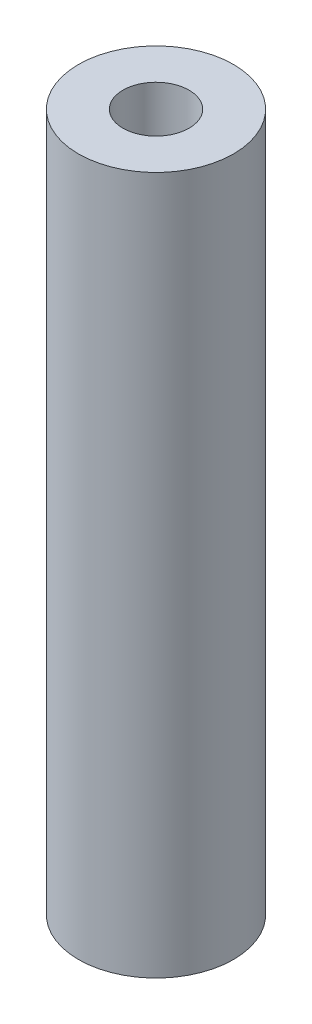
ISO-10303-21;
HEADER;
FILE_DESCRIPTION(('STEP AP214'),'2;1');
FILE_NAME('part.step','',(''),(''),'','','');
FILE_SCHEMA(('AUTOMOTIVE_DESIGN { 1 0 10303 214 1 1 1 1 }'));
ENDSEC;
DATA;
#1=APPLICATION_CONTEXT('core data for automotive mechanical design processes');
#2=APPLICATION_PROTOCOL_DEFINITION('international standard','automotive_design',2000,#1);
#3=PRODUCT_CONTEXT('',#1,'mechanical');
#4=PRODUCT('Part','Part','',(#3));
#5=PRODUCT_RELATED_PRODUCT_CATEGORY('part','',(#4));
#6=PRODUCT_DEFINITION_FORMATION('','',#4);
#7=PRODUCT_DEFINITION_CONTEXT('part definition',#1,'design');
#8=PRODUCT_DEFINITION('design','',#6,#7);
#9=PRODUCT_DEFINITION_SHAPE('','',#8);
#10=(LENGTH_UNIT() NAMED_UNIT(*) SI_UNIT(.MILLI.,.METRE.));
#11=(NAMED_UNIT(*) PLANE_ANGLE_UNIT() SI_UNIT($,.RADIAN.));
#12=(NAMED_UNIT(*) SI_UNIT($,.STERADIAN.) SOLID_ANGLE_UNIT());
#13=UNCERTAINTY_MEASURE_WITH_UNIT(LENGTH_MEASURE(1.E-05),#10,'distance_accuracy_value','');
#14=(GEOMETRIC_REPRESENTATION_CONTEXT(3) GLOBAL_UNCERTAINTY_ASSIGNED_CONTEXT((#13)) GLOBAL_UNIT_ASSIGNED_CONTEXT((#10,
#11,#12)) REPRESENTATION_CONTEXT('',''));
#15=CARTESIAN_POINT('',(0.,0.,0.));
#16=DIRECTION('',(0.,0.,1.));
#17=DIRECTION('',(1.,0.,0.));
#18=AXIS2_PLACEMENT_3D('',#15,#16,#17);
#19=CARTESIAN_POINT('',(0.,28.575,0.));
#20=DIRECTION('',(0.,-1.,0.));
#21=DIRECTION('',(0.,0.,-1.));
#22=AXIS2_PLACEMENT_3D('',#19,#20,#21);
#23=CYLINDRICAL_SURFACE('',#22,3.175);
#24=CARTESIAN_POINT('',(0.,28.575,0.));
#25=DIRECTION('',(0.,1.,0.));
#26=DIRECTION('',(0.,0.,1.));
#27=AXIS2_PLACEMENT_3D('',#24,#25,#26);
#28=CIRCLE('',#27,3.175);
#29=CARTESIAN_POINT('',(0.,28.575,3.175));
#30=VERTEX_POINT('',#29);
#31=EDGE_CURVE('E10',#30,#30,#28,.T.);
#32=ORIENTED_EDGE('',*,*,#31,.F.);
#33=EDGE_LOOP('',(#32));
#34=FACE_BOUND('',#33,.T.);
#35=CARTESIAN_POINT('',(0.,0.,0.));
#36=DIRECTION('',(0.,1.,0.));
#37=DIRECTION('',(0.,0.,1.));
#38=AXIS2_PLACEMENT_3D('',#35,#36,#37);
#39=CIRCLE('',#38,3.175);
#40=CARTESIAN_POINT('',(0.,0.,3.175));
#41=VERTEX_POINT('',#40);
#42=EDGE_CURVE('E34',#41,#41,#39,.T.);
#43=ORIENTED_EDGE('',*,*,#42,.T.);
#44=EDGE_LOOP('',(#43));
#45=FACE_BOUND('',#44,.T.);
#46=ADVANCED_FACE('F31',(#34,#45),#23,.T.);
#47=CARTESIAN_POINT('',(0.,28.575,0.));
#48=DIRECTION('',(0.,1.,0.));
#49=DIRECTION('',(0.,0.,1.));
#50=AXIS2_PLACEMENT_3D('',#47,#48,#49);
#51=PLANE('',#50);
#52=CARTESIAN_POINT('',(0.,28.575,0.));
#53=DIRECTION('',(0.,1.,0.));
#54=DIRECTION('',(0.,0.,1.));
#55=AXIS2_PLACEMENT_3D('',#52,#53,#54);
#56=CIRCLE('',#55,1.35254999999999);
#57=CARTESIAN_POINT('',(0.,28.575,1.35254999999999));
#58=VERTEX_POINT('',#57);
#59=EDGE_CURVE('E45',#58,#58,#56,.T.);
#60=ORIENTED_EDGE('',*,*,#59,.F.);
#61=EDGE_LOOP('',(#60));
#62=FACE_BOUND('',#61,.T.);
#63=ORIENTED_EDGE('',*,*,#31,.T.);
#64=EDGE_LOOP('',(#63));
#65=FACE_BOUND('',#64,.T.);
#66=ADVANCED_FACE('F51',(#62,#65),#51,.T.);
#67=CARTESIAN_POINT('',(0.,0.,0.));
#68=DIRECTION('',(0.,1.,0.));
#69=DIRECTION('',(0.,0.,1.));
#70=AXIS2_PLACEMENT_3D('',#67,#68,#69);
#71=PLANE('',#70);
#72=CARTESIAN_POINT('',(0.,0.,0.));
#73=DIRECTION('',(0.,1.,0.));
#74=DIRECTION('',(0.,0.,1.));
#75=AXIS2_PLACEMENT_3D('',#72,#73,#74);
#76=CIRCLE('',#75,1.35254999999999);
#77=CARTESIAN_POINT('',(0.,0.,1.35254999999999));
#78=VERTEX_POINT('',#77);
#79=EDGE_CURVE('E41',#78,#78,#76,.T.);
#80=ORIENTED_EDGE('',*,*,#79,.T.);
#81=EDGE_LOOP('',(#80));
#82=FACE_BOUND('',#81,.T.);
#83=ORIENTED_EDGE('',*,*,#42,.F.);
#84=EDGE_LOOP('',(#83));
#85=FACE_BOUND('',#84,.T.);
#86=ADVANCED_FACE('F53',(#82,#85),#71,.F.);
#87=CARTESIAN_POINT('',(0.,28.575,0.));
#88=DIRECTION('',(0.,1.,0.));
#89=DIRECTION('',(0.,0.,1.));
#90=AXIS2_PLACEMENT_3D('',#87,#88,#89);
#91=CYLINDRICAL_SURFACE('',#90,1.35254999999999);
#92=ORIENTED_EDGE('',*,*,#79,.F.);
#93=EDGE_LOOP('',(#92));
#94=FACE_BOUND('',#93,.T.);
#95=ORIENTED_EDGE('',*,*,#59,.T.);
#96=EDGE_LOOP('',(#95));
#97=FACE_BOUND('',#96,.T.);
#98=ADVANCED_FACE('F49',(#94,#97),#91,.F.);
#99=CLOSED_SHELL('',(#46,#66,#86,#98));
#100=MANIFOLD_SOLID_BREP('B2',#99);
#101=ADVANCED_BREP_SHAPE_REPRESENTATION('',(#18,#100),#14);
#102=SHAPE_DEFINITION_REPRESENTATION(#9,#101);
ENDSEC;
END-ISO-10303-21;
